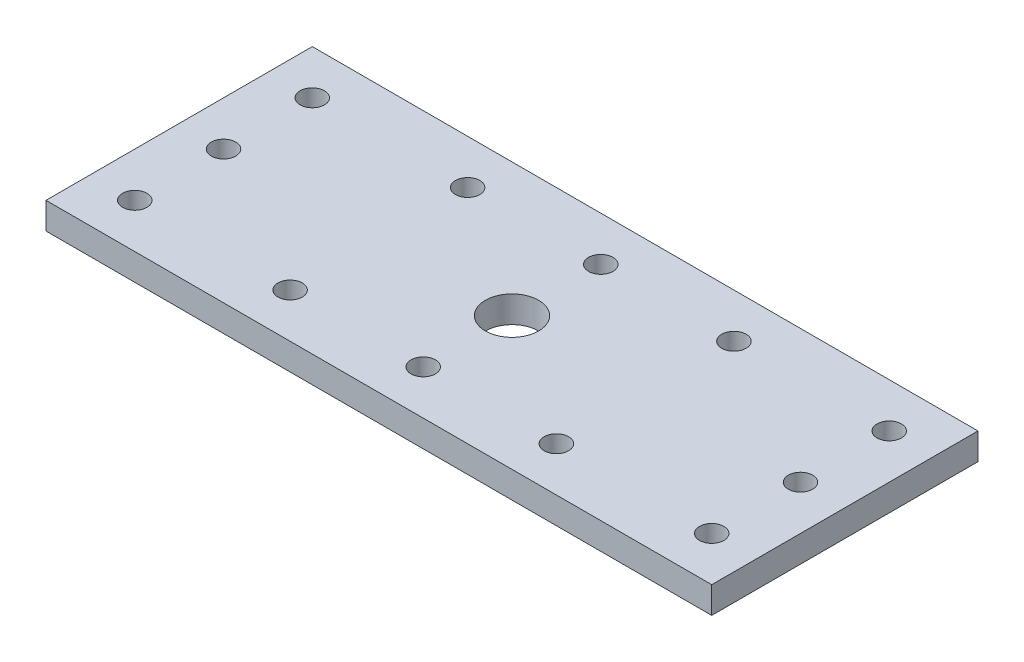
ISO-10303-21;
HEADER;
FILE_DESCRIPTION(('STEP AP214'),'2;1');
FILE_NAME('part.step','',(''),(''),'','','');
FILE_SCHEMA(('AUTOMOTIVE_DESIGN { 1 0 10303 214 1 1 1 1 }'));
ENDSEC;
DATA;
#1=APPLICATION_CONTEXT('core data for automotive mechanical design processes');
#2=APPLICATION_PROTOCOL_DEFINITION('international standard','automotive_design',2000,#1);
#3=PRODUCT_CONTEXT('',#1,'mechanical');
#4=PRODUCT('Part','Part','',(#3));
#5=PRODUCT_RELATED_PRODUCT_CATEGORY('part','',(#4));
#6=PRODUCT_DEFINITION_FORMATION('','',#4);
#7=PRODUCT_DEFINITION_CONTEXT('part definition',#1,'design');
#8=PRODUCT_DEFINITION('design','',#6,#7);
#9=PRODUCT_DEFINITION_SHAPE('','',#8);
#10=(LENGTH_UNIT() NAMED_UNIT(*) SI_UNIT(.MILLI.,.METRE.));
#11=(NAMED_UNIT(*) PLANE_ANGLE_UNIT() SI_UNIT($,.RADIAN.));
#12=(NAMED_UNIT(*) SI_UNIT($,.STERADIAN.) SOLID_ANGLE_UNIT());
#13=UNCERTAINTY_MEASURE_WITH_UNIT(LENGTH_MEASURE(1.E-05),#10,'distance_accuracy_value','');
#14=(GEOMETRIC_REPRESENTATION_CONTEXT(3) GLOBAL_UNCERTAINTY_ASSIGNED_CONTEXT((#13)) GLOBAL_UNIT_ASSIGNED_CONTEXT((#10,
#11,#12)) REPRESENTATION_CONTEXT('',''));
#15=CARTESIAN_POINT('',(0.,0.,0.));
#16=DIRECTION('',(0.,0.,1.));
#17=DIRECTION('',(1.,0.,0.));
#18=AXIS2_PLACEMENT_3D('',#15,#16,#17);
#19=CARTESIAN_POINT('',(0.,94.9999999999997,30.0000000000001));
#20=DIRECTION('',(0.,1.,0.));
#21=DIRECTION('',(-1.,0.,0.));
#22=AXIS2_PLACEMENT_3D('',#19,#20,#21);
#23=PLANE('',#22);
#24=CARTESIAN_POINT('',(-65.,94.9999999999998,30.));
#25=DIRECTION('',(0.,1.,0.));
#26=DIRECTION('',(0.,0.,1.));
#27=AXIS2_PLACEMENT_3D('',#24,#25,#26);
#28=CIRCLE('',#27,2.75);
#29=CARTESIAN_POINT('',(-65.,94.9999999999998,32.75));
#30=VERTEX_POINT('',#29);
#31=EDGE_CURVE('E118',#30,#30,#28,.T.);
#32=ORIENTED_EDGE('',*,*,#31,.T.);
#33=EDGE_LOOP('',(#32));
#34=FACE_BOUND('',#33,.T.);
#35=CARTESIAN_POINT('',(0.,94.9999999999998,9.99999999999993));
#36=DIRECTION('',(0.,1.,0.));
#37=DIRECTION('',(0.,0.,1.));
#38=AXIS2_PLACEMENT_3D('',#35,#36,#37);
#39=CIRCLE('',#38,2.75);
#40=CARTESIAN_POINT('',(0.,94.9999999999998,12.7499999999999));
#41=VERTEX_POINT('',#40);
#42=EDGE_CURVE('E122',#41,#41,#39,.T.);
#43=ORIENTED_EDGE('',*,*,#42,.T.);
#44=EDGE_LOOP('',(#43));
#45=FACE_BOUND('',#44,.T.);
#46=CARTESIAN_POINT('',(65.,94.9999999999997,30.));
#47=DIRECTION('',(0.,1.,0.));
#48=DIRECTION('',(0.,0.,1.));
#49=AXIS2_PLACEMENT_3D('',#46,#47,#48);
#50=CIRCLE('',#49,2.75);
#51=CARTESIAN_POINT('',(65.,94.9999999999997,32.75));
#52=VERTEX_POINT('',#51);
#53=EDGE_CURVE('E125',#52,#52,#50,.T.);
#54=ORIENTED_EDGE('',*,*,#53,.T.);
#55=EDGE_LOOP('',(#54));
#56=FACE_BOUND('',#55,.T.);
#57=CARTESIAN_POINT('',(30.,94.9999999999997,50.0000000000001));
#58=DIRECTION('',(0.,1.,0.));
#59=DIRECTION('',(0.,0.,1.));
#60=AXIS2_PLACEMENT_3D('',#57,#58,#59);
#61=CIRCLE('',#60,2.75);
#62=CARTESIAN_POINT('',(30.,94.9999999999997,52.7500000000001));
#63=VERTEX_POINT('',#62);
#64=EDGE_CURVE('E128',#63,#63,#61,.T.);
#65=ORIENTED_EDGE('',*,*,#64,.T.);
#66=EDGE_LOOP('',(#65));
#67=FACE_BOUND('',#66,.T.);
#68=CARTESIAN_POINT('',(-30.,94.9999999999997,9.99999999999993));
#69=DIRECTION('',(0.,1.,0.));
#70=DIRECTION('',(0.,0.,1.));
#71=AXIS2_PLACEMENT_3D('',#68,#69,#70);
#72=CIRCLE('',#71,2.75);
#73=CARTESIAN_POINT('',(-30.,94.9999999999997,12.7499999999999));
#74=VERTEX_POINT('',#73);
#75=EDGE_CURVE('E131',#74,#74,#72,.T.);
#76=ORIENTED_EDGE('',*,*,#75,.T.);
#77=EDGE_LOOP('',(#76));
#78=FACE_BOUND('',#77,.T.);
#79=CARTESIAN_POINT('',(-65.,94.9999999999997,50.0000000000001));
#80=DIRECTION('',(0.,1.,0.));
#81=DIRECTION('',(0.,0.,1.));
#82=AXIS2_PLACEMENT_3D('',#79,#80,#81);
#83=CIRCLE('',#82,2.75);
#84=CARTESIAN_POINT('',(-65.,94.9999999999997,52.7500000000001));
#85=VERTEX_POINT('',#84);
#86=EDGE_CURVE('E134',#85,#85,#83,.T.);
#87=ORIENTED_EDGE('',*,*,#86,.T.);
#88=EDGE_LOOP('',(#87));
#89=FACE_BOUND('',#88,.T.);
#90=CARTESIAN_POINT('',(-65.,94.9999999999998,9.99999999999992));
#91=DIRECTION('',(0.,1.,0.));
#92=DIRECTION('',(0.,0.,1.));
#93=AXIS2_PLACEMENT_3D('',#90,#91,#92);
#94=CIRCLE('',#93,2.75);
#95=CARTESIAN_POINT('',(-65.,94.9999999999998,12.7499999999999));
#96=VERTEX_POINT('',#95);
#97=EDGE_CURVE('E137',#96,#96,#94,.T.);
#98=ORIENTED_EDGE('',*,*,#97,.T.);
#99=EDGE_LOOP('',(#98));
#100=FACE_BOUND('',#99,.T.);
#101=CARTESIAN_POINT('',(-30.,94.9999999999997,50.0000000000001));
#102=DIRECTION('',(0.,1.,0.));
#103=DIRECTION('',(0.,0.,1.));
#104=AXIS2_PLACEMENT_3D('',#101,#102,#103);
#105=CIRCLE('',#104,2.75);
#106=CARTESIAN_POINT('',(-30.,94.9999999999997,52.7500000000001));
#107=VERTEX_POINT('',#106);
#108=EDGE_CURVE('E140',#107,#107,#105,.T.);
#109=ORIENTED_EDGE('',*,*,#108,.T.);
#110=EDGE_LOOP('',(#109));
#111=FACE_BOUND('',#110,.T.);
#112=CARTESIAN_POINT('',(30.,94.9999999999997,9.99999999999993));
#113=DIRECTION('',(0.,1.,0.));
#114=DIRECTION('',(0.,0.,1.));
#115=AXIS2_PLACEMENT_3D('',#112,#113,#114);
#116=CIRCLE('',#115,2.75);
#117=CARTESIAN_POINT('',(30.,94.9999999999997,12.7499999999999));
#118=VERTEX_POINT('',#117);
#119=EDGE_CURVE('E143',#118,#118,#116,.T.);
#120=ORIENTED_EDGE('',*,*,#119,.T.);
#121=EDGE_LOOP('',(#120));
#122=FACE_BOUND('',#121,.T.);
#123=CARTESIAN_POINT('',(65.,94.9999999999997,50.0000000000001));
#124=DIRECTION('',(0.,1.,0.));
#125=DIRECTION('',(0.,0.,1.));
#126=AXIS2_PLACEMENT_3D('',#123,#124,#125);
#127=CIRCLE('',#126,2.75);
#128=CARTESIAN_POINT('',(65.,94.9999999999997,52.7500000000001));
#129=VERTEX_POINT('',#128);
#130=EDGE_CURVE('E146',#129,#129,#127,.T.);
#131=ORIENTED_EDGE('',*,*,#130,.T.);
#132=EDGE_LOOP('',(#131));
#133=FACE_BOUND('',#132,.T.);
#134=CARTESIAN_POINT('',(65.,94.9999999999997,9.99999999999993));
#135=DIRECTION('',(0.,1.,0.));
#136=DIRECTION('',(0.,0.,1.));
#137=AXIS2_PLACEMENT_3D('',#134,#135,#136);
#138=CIRCLE('',#137,2.75);
#139=CARTESIAN_POINT('',(65.,94.9999999999997,12.7499999999999));
#140=VERTEX_POINT('',#139);
#141=EDGE_CURVE('E149',#140,#140,#138,.T.);
#142=ORIENTED_EDGE('',*,*,#141,.T.);
#143=EDGE_LOOP('',(#142));
#144=FACE_BOUND('',#143,.T.);
#145=CARTESIAN_POINT('',(0.,94.9999999999997,50.0000000000001));
#146=DIRECTION('',(0.,1.,0.));
#147=DIRECTION('',(0.,0.,1.));
#148=AXIS2_PLACEMENT_3D('',#145,#146,#147);
#149=CIRCLE('',#148,2.75);
#150=CARTESIAN_POINT('',(0.,94.9999999999997,52.7500000000001));
#151=VERTEX_POINT('',#150);
#152=EDGE_CURVE('E151',#151,#151,#149,.T.);
#153=ORIENTED_EDGE('',*,*,#152,.T.);
#154=EDGE_LOOP('',(#153));
#155=FACE_BOUND('',#154,.T.);
#156=CARTESIAN_POINT('',(0.,94.9999999999998,30.0000000000001));
#157=DIRECTION('',(0.,1.,0.));
#158=DIRECTION('',(0.,0.,1.));
#159=AXIS2_PLACEMENT_3D('',#156,#157,#158);
#160=CIRCLE('',#159,6.);
#161=CARTESIAN_POINT('',(0.,94.9999999999998,36.0000000000001));
#162=VERTEX_POINT('',#161);
#163=EDGE_CURVE('E20',#162,#162,#160,.T.);
#164=ORIENTED_EDGE('',*,*,#163,.T.);
#165=EDGE_LOOP('',(#164));
#166=FACE_BOUND('',#165,.T.);
#167=DIRECTION('',(0.,0.,1.));
#168=VECTOR('',#167,1.);
#169=CARTESIAN_POINT('',(-75.,94.9999999999998,0.));
#170=LINE('',#169,#168);
#171=CARTESIAN_POINT('',(-75.,94.9999999999998,0.));
#172=VERTEX_POINT('',#171);
#173=CARTESIAN_POINT('',(-75.,94.9999999999998,60.0000000000001));
#174=VERTEX_POINT('',#173);
#175=EDGE_CURVE('E160',#172,#174,#170,.T.);
#176=ORIENTED_EDGE('',*,*,#175,.F.);
#177=DIRECTION('',(-1.,0.,0.));
#178=VECTOR('',#177,1.);
#179=CARTESIAN_POINT('',(75.,94.9999999999997,0.));
#180=LINE('',#179,#178);
#181=CARTESIAN_POINT('',(75.,94.9999999999997,0.));
#182=VERTEX_POINT('',#181);
#183=EDGE_CURVE('E55',#182,#172,#180,.T.);
#184=ORIENTED_EDGE('',*,*,#183,.F.);
#185=DIRECTION('',(0.,0.,1.));
#186=VECTOR('',#185,1.);
#187=CARTESIAN_POINT('',(75.,94.9999999999997,60.0000000000001));
#188=LINE('',#187,#186);
#189=CARTESIAN_POINT('',(75.,94.9999999999997,60.0000000000001));
#190=VERTEX_POINT('',#189);
#191=EDGE_CURVE('E57',#190,#182,#188,.F.);
#192=ORIENTED_EDGE('',*,*,#191,.F.);
#193=DIRECTION('',(1.,0.,0.));
#194=VECTOR('',#193,1.);
#195=CARTESIAN_POINT('',(-75.,94.9999999999997,60.0000000000001));
#196=LINE('',#195,#194);
#197=EDGE_CURVE('E59',#174,#190,#196,.T.);
#198=ORIENTED_EDGE('',*,*,#197,.F.);
#199=EDGE_LOOP('',(#176,#184,#192,#198));
#200=FACE_BOUND('',#199,.T.);
#201=ADVANCED_FACE('F17',(#34,#45,#56,#67,#78,#89,#100,#111,#122,#133,#144,#155,#166,#200),#23,.F.);
#202=CARTESIAN_POINT('',(-75.,94.9999999999997,60.0000000000001));
#203=DIRECTION('',(0.,0.,1.));
#204=DIRECTION('',(1.,0.,0.));
#205=AXIS2_PLACEMENT_3D('',#202,#203,#204);
#206=PLANE('',#205);
#207=DIRECTION('',(-1.,0.,0.));
#208=VECTOR('',#207,1.);
#209=CARTESIAN_POINT('',(0.,101.,60.0000000000001));
#210=LINE('',#209,#208);
#211=CARTESIAN_POINT('',(-75.,101.,60.0000000000001));
#212=VERTEX_POINT('',#211);
#213=CARTESIAN_POINT('',(75.,101.,60.0000000000001));
#214=VERTEX_POINT('',#213);
#215=EDGE_CURVE('E121',#212,#214,#210,.F.);
#216=ORIENTED_EDGE('',*,*,#215,.F.);
#217=DIRECTION('',(0.,-1.,0.));
#218=VECTOR('',#217,1.);
#219=CARTESIAN_POINT('',(-75.,94.9999999999998,60.0000000000001));
#220=LINE('',#219,#218);
#221=EDGE_CURVE('E70',#174,#212,#220,.F.);
#222=ORIENTED_EDGE('',*,*,#221,.F.);
#223=ORIENTED_EDGE('',*,*,#197,.T.);
#224=DIRECTION('',(0.,1.,0.));
#225=VECTOR('',#224,1.);
#226=CARTESIAN_POINT('',(75.,94.9999999999997,60.0000000000001));
#227=LINE('',#226,#225);
#228=EDGE_CURVE('E64',#214,#190,#227,.F.);
#229=ORIENTED_EDGE('',*,*,#228,.F.);
#230=EDGE_LOOP('',(#216,#222,#223,#229));
#231=FACE_BOUND('',#230,.T.);
#232=ADVANCED_FACE('F67',(#231),#206,.T.);
#233=CARTESIAN_POINT('',(75.,94.9999999999997,60.0000000000001));
#234=DIRECTION('',(1.,0.,0.));
#235=DIRECTION('',(0.,1.,0.));
#236=AXIS2_PLACEMENT_3D('',#233,#234,#235);
#237=PLANE('',#236);
#238=DIRECTION('',(0.,0.,1.));
#239=VECTOR('',#238,1.);
#240=CARTESIAN_POINT('',(75.,101.,30.0000000000001));
#241=LINE('',#240,#239);
#242=CARTESIAN_POINT('',(75.,101.,0.));
#243=VERTEX_POINT('',#242);
#244=EDGE_CURVE('E75',#214,#243,#241,.F.);
#245=ORIENTED_EDGE('',*,*,#244,.F.);
#246=ORIENTED_EDGE('',*,*,#228,.T.);
#247=ORIENTED_EDGE('',*,*,#191,.T.);
#248=DIRECTION('',(0.,1.,0.));
#249=VECTOR('',#248,1.);
#250=CARTESIAN_POINT('',(75.,94.9999999999997,0.));
#251=LINE('',#250,#249);
#252=EDGE_CURVE('E78',#243,#182,#251,.F.);
#253=ORIENTED_EDGE('',*,*,#252,.F.);
#254=EDGE_LOOP('',(#245,#246,#247,#253));
#255=FACE_BOUND('',#254,.T.);
#256=ADVANCED_FACE('F73',(#255),#237,.T.);
#257=CARTESIAN_POINT('',(75.,94.9999999999997,0.));
#258=DIRECTION('',(0.,0.,-1.));
#259=DIRECTION('',(-1.,0.,0.));
#260=AXIS2_PLACEMENT_3D('',#257,#258,#259);
#261=PLANE('',#260);
#262=DIRECTION('',(-1.,0.,0.));
#263=VECTOR('',#262,1.);
#264=CARTESIAN_POINT('',(0.,101.,0.));
#265=LINE('',#264,#263);
#266=CARTESIAN_POINT('',(-75.,101.,0.));
#267=VERTEX_POINT('',#266);
#268=EDGE_CURVE('E167',#243,#267,#265,.T.);
#269=ORIENTED_EDGE('',*,*,#268,.F.);
#270=ORIENTED_EDGE('',*,*,#252,.T.);
#271=ORIENTED_EDGE('',*,*,#183,.T.);
#272=DIRECTION('',(0.,-1.,0.));
#273=VECTOR('',#272,1.);
#274=CARTESIAN_POINT('',(-75.,94.9999999999998,0.));
#275=LINE('',#274,#273);
#276=EDGE_CURVE('E35',#267,#172,#275,.T.);
#277=ORIENTED_EDGE('',*,*,#276,.F.);
#278=EDGE_LOOP('',(#269,#270,#271,#277));
#279=FACE_BOUND('',#278,.T.);
#280=ADVANCED_FACE('F165',(#279),#261,.T.);
#281=CARTESIAN_POINT('',(-75.,94.9999999999998,0.));
#282=DIRECTION('',(-1.,0.,0.));
#283=DIRECTION('',(0.,-1.,0.));
#284=AXIS2_PLACEMENT_3D('',#281,#282,#283);
#285=PLANE('',#284);
#286=DIRECTION('',(0.,0.,1.));
#287=VECTOR('',#286,1.);
#288=CARTESIAN_POINT('',(-75.,101.,30.0000000000001));
#289=LINE('',#288,#287);
#290=EDGE_CURVE('E117',#267,#212,#289,.T.);
#291=ORIENTED_EDGE('',*,*,#290,.F.);
#292=ORIENTED_EDGE('',*,*,#276,.T.);
#293=ORIENTED_EDGE('',*,*,#175,.T.);
#294=ORIENTED_EDGE('',*,*,#221,.T.);
#295=EDGE_LOOP('',(#291,#292,#293,#294));
#296=FACE_BOUND('',#295,.T.);
#297=ADVANCED_FACE('F173',(#296),#285,.T.);
#298=CARTESIAN_POINT('',(0.,98.2999999999998,30.0000000000001));
#299=DIRECTION('',(0.,1.,0.));
#300=DIRECTION('',(0.,0.,1.));
#301=AXIS2_PLACEMENT_3D('',#298,#299,#300);
#302=CYLINDRICAL_SURFACE('',#301,6.);
#303=CARTESIAN_POINT('',(0.,101.,30.0000000000001));
#304=DIRECTION('',(0.,1.,0.));
#305=DIRECTION('',(0.,0.,1.));
#306=AXIS2_PLACEMENT_3D('',#303,#304,#305);
#307=CIRCLE('',#306,6.);
#308=CARTESIAN_POINT('',(0.,101.,36.0000000000001));
#309=VERTEX_POINT('',#308);
#310=EDGE_CURVE('E114',#309,#309,#307,.F.);
#311=ORIENTED_EDGE('',*,*,#310,.F.);
#312=EDGE_LOOP('',(#311));
#313=FACE_BOUND('',#312,.T.);
#314=ORIENTED_EDGE('',*,*,#163,.F.);
#315=EDGE_LOOP('',(#314));
#316=FACE_BOUND('',#315,.T.);
#317=ADVANCED_FACE('F175',(#313,#316),#302,.F.);
#318=CARTESIAN_POINT('',(0.,98.2999999999998,50.0000000000001));
#319=DIRECTION('',(0.,1.,0.));
#320=DIRECTION('',(0.,0.,1.));
#321=AXIS2_PLACEMENT_3D('',#318,#319,#320);
#322=CYLINDRICAL_SURFACE('',#321,2.75);
#323=CARTESIAN_POINT('',(0.,101.,50.0000000000001));
#324=DIRECTION('',(0.,1.,0.));
#325=DIRECTION('',(0.,0.,1.));
#326=AXIS2_PLACEMENT_3D('',#323,#324,#325);
#327=CIRCLE('',#326,2.75);
#328=CARTESIAN_POINT('',(0.,101.,52.7500000000001));
#329=VERTEX_POINT('',#328);
#330=EDGE_CURVE('E111',#329,#329,#327,.F.);
#331=ORIENTED_EDGE('',*,*,#330,.F.);
#332=EDGE_LOOP('',(#331));
#333=FACE_BOUND('',#332,.T.);
#334=ORIENTED_EDGE('',*,*,#152,.F.);
#335=EDGE_LOOP('',(#334));
#336=FACE_BOUND('',#335,.T.);
#337=ADVANCED_FACE('F182',(#333,#336),#322,.F.);
#338=CARTESIAN_POINT('',(65.,98.2999999999998,9.99999999999993));
#339=DIRECTION('',(0.,1.,0.));
#340=DIRECTION('',(0.,0.,1.));
#341=AXIS2_PLACEMENT_3D('',#338,#339,#340);
#342=CYLINDRICAL_SURFACE('',#341,2.75);
#343=CARTESIAN_POINT('',(65.,101.,9.99999999999993));
#344=DIRECTION('',(0.,1.,0.));
#345=DIRECTION('',(0.,0.,1.));
#346=AXIS2_PLACEMENT_3D('',#343,#344,#345);
#347=CIRCLE('',#346,2.75);
#348=CARTESIAN_POINT('',(65.,101.,12.7499999999999));
#349=VERTEX_POINT('',#348);
#350=EDGE_CURVE('E108',#349,#349,#347,.F.);
#351=ORIENTED_EDGE('',*,*,#350,.F.);
#352=EDGE_LOOP('',(#351));
#353=FACE_BOUND('',#352,.T.);
#354=ORIENTED_EDGE('',*,*,#141,.F.);
#355=EDGE_LOOP('',(#354));
#356=FACE_BOUND('',#355,.T.);
#357=ADVANCED_FACE('F232',(#353,#356),#342,.F.);
#358=CARTESIAN_POINT('',(65.,98.2999999999998,50.0000000000001));
#359=DIRECTION('',(0.,1.,0.));
#360=DIRECTION('',(0.,0.,1.));
#361=AXIS2_PLACEMENT_3D('',#358,#359,#360);
#362=CYLINDRICAL_SURFACE('',#361,2.75);
#363=CARTESIAN_POINT('',(65.,101.,50.0000000000001));
#364=DIRECTION('',(0.,1.,0.));
#365=DIRECTION('',(0.,0.,1.));
#366=AXIS2_PLACEMENT_3D('',#363,#364,#365);
#367=CIRCLE('',#366,2.75);
#368=CARTESIAN_POINT('',(65.,101.,52.7500000000001));
#369=VERTEX_POINT('',#368);
#370=EDGE_CURVE('E105',#369,#369,#367,.F.);
#371=ORIENTED_EDGE('',*,*,#370,.F.);
#372=EDGE_LOOP('',(#371));
#373=FACE_BOUND('',#372,.T.);
#374=ORIENTED_EDGE('',*,*,#130,.F.);
#375=EDGE_LOOP('',(#374));
#376=FACE_BOUND('',#375,.T.);
#377=ADVANCED_FACE('F228',(#373,#376),#362,.F.);
#378=CARTESIAN_POINT('',(30.,98.2999999999998,9.99999999999993));
#379=DIRECTION('',(0.,1.,0.));
#380=DIRECTION('',(0.,0.,1.));
#381=AXIS2_PLACEMENT_3D('',#378,#379,#380);
#382=CYLINDRICAL_SURFACE('',#381,2.75);
#383=CARTESIAN_POINT('',(30.,101.,9.99999999999993));
#384=DIRECTION('',(0.,1.,0.));
#385=DIRECTION('',(0.,0.,1.));
#386=AXIS2_PLACEMENT_3D('',#383,#384,#385);
#387=CIRCLE('',#386,2.75);
#388=CARTESIAN_POINT('',(30.,101.,12.7499999999999));
#389=VERTEX_POINT('',#388);
#390=EDGE_CURVE('E102',#389,#389,#387,.F.);
#391=ORIENTED_EDGE('',*,*,#390,.F.);
#392=EDGE_LOOP('',(#391));
#393=FACE_BOUND('',#392,.T.);
#394=ORIENTED_EDGE('',*,*,#119,.F.);
#395=EDGE_LOOP('',(#394));
#396=FACE_BOUND('',#395,.T.);
#397=ADVANCED_FACE('F224',(#393,#396),#382,.F.);
#398=CARTESIAN_POINT('',(-30.,98.2999999999998,50.0000000000001));
#399=DIRECTION('',(0.,1.,0.));
#400=DIRECTION('',(0.,0.,1.));
#401=AXIS2_PLACEMENT_3D('',#398,#399,#400);
#402=CYLINDRICAL_SURFACE('',#401,2.75);
#403=CARTESIAN_POINT('',(-30.,101.,50.0000000000001));
#404=DIRECTION('',(0.,1.,0.));
#405=DIRECTION('',(0.,0.,1.));
#406=AXIS2_PLACEMENT_3D('',#403,#404,#405);
#407=CIRCLE('',#406,2.75);
#408=CARTESIAN_POINT('',(-30.,101.,52.7500000000001));
#409=VERTEX_POINT('',#408);
#410=EDGE_CURVE('E99',#409,#409,#407,.F.);
#411=ORIENTED_EDGE('',*,*,#410,.F.);
#412=EDGE_LOOP('',(#411));
#413=FACE_BOUND('',#412,.T.);
#414=ORIENTED_EDGE('',*,*,#108,.F.);
#415=EDGE_LOOP('',(#414));
#416=FACE_BOUND('',#415,.T.);
#417=ADVANCED_FACE('F220',(#413,#416),#402,.F.);
#418=CARTESIAN_POINT('',(-65.,98.2999999999998,9.99999999999992));
#419=DIRECTION('',(0.,1.,0.));
#420=DIRECTION('',(0.,0.,1.));
#421=AXIS2_PLACEMENT_3D('',#418,#419,#420);
#422=CYLINDRICAL_SURFACE('',#421,2.75);
#423=CARTESIAN_POINT('',(-65.,101.,9.99999999999992));
#424=DIRECTION('',(0.,1.,0.));
#425=DIRECTION('',(0.,0.,1.));
#426=AXIS2_PLACEMENT_3D('',#423,#424,#425);
#427=CIRCLE('',#426,2.75);
#428=CARTESIAN_POINT('',(-65.,101.,12.7499999999999));
#429=VERTEX_POINT('',#428);
#430=EDGE_CURVE('E96',#429,#429,#427,.F.);
#431=ORIENTED_EDGE('',*,*,#430,.F.);
#432=EDGE_LOOP('',(#431));
#433=FACE_BOUND('',#432,.T.);
#434=ORIENTED_EDGE('',*,*,#97,.F.);
#435=EDGE_LOOP('',(#434));
#436=FACE_BOUND('',#435,.T.);
#437=ADVANCED_FACE('F216',(#433,#436),#422,.F.);
#438=CARTESIAN_POINT('',(-65.,98.2999999999998,50.0000000000001));
#439=DIRECTION('',(0.,1.,0.));
#440=DIRECTION('',(0.,0.,1.));
#441=AXIS2_PLACEMENT_3D('',#438,#439,#440);
#442=CYLINDRICAL_SURFACE('',#441,2.75);
#443=CARTESIAN_POINT('',(-65.,101.,50.0000000000001));
#444=DIRECTION('',(0.,1.,0.));
#445=DIRECTION('',(0.,0.,1.));
#446=AXIS2_PLACEMENT_3D('',#443,#444,#445);
#447=CIRCLE('',#446,2.75);
#448=CARTESIAN_POINT('',(-65.,101.,52.7500000000001));
#449=VERTEX_POINT('',#448);
#450=EDGE_CURVE('E93',#449,#449,#447,.F.);
#451=ORIENTED_EDGE('',*,*,#450,.F.);
#452=EDGE_LOOP('',(#451));
#453=FACE_BOUND('',#452,.T.);
#454=ORIENTED_EDGE('',*,*,#86,.F.);
#455=EDGE_LOOP('',(#454));
#456=FACE_BOUND('',#455,.T.);
#457=ADVANCED_FACE('F212',(#453,#456),#442,.F.);
#458=CARTESIAN_POINT('',(-30.,98.2999999999998,9.99999999999993));
#459=DIRECTION('',(0.,1.,0.));
#460=DIRECTION('',(0.,0.,1.));
#461=AXIS2_PLACEMENT_3D('',#458,#459,#460);
#462=CYLINDRICAL_SURFACE('',#461,2.75);
#463=CARTESIAN_POINT('',(-30.,101.,9.99999999999993));
#464=DIRECTION('',(0.,1.,0.));
#465=DIRECTION('',(0.,0.,1.));
#466=AXIS2_PLACEMENT_3D('',#463,#464,#465);
#467=CIRCLE('',#466,2.75);
#468=CARTESIAN_POINT('',(-30.,101.,12.7499999999999));
#469=VERTEX_POINT('',#468);
#470=EDGE_CURVE('E90',#469,#469,#467,.F.);
#471=ORIENTED_EDGE('',*,*,#470,.F.);
#472=EDGE_LOOP('',(#471));
#473=FACE_BOUND('',#472,.T.);
#474=ORIENTED_EDGE('',*,*,#75,.F.);
#475=EDGE_LOOP('',(#474));
#476=FACE_BOUND('',#475,.T.);
#477=ADVANCED_FACE('F208',(#473,#476),#462,.F.);
#478=CARTESIAN_POINT('',(30.,98.2999999999998,50.0000000000001));
#479=DIRECTION('',(0.,1.,0.));
#480=DIRECTION('',(0.,0.,1.));
#481=AXIS2_PLACEMENT_3D('',#478,#479,#480);
#482=CYLINDRICAL_SURFACE('',#481,2.75);
#483=CARTESIAN_POINT('',(30.,101.,50.0000000000001));
#484=DIRECTION('',(0.,1.,0.));
#485=DIRECTION('',(0.,0.,1.));
#486=AXIS2_PLACEMENT_3D('',#483,#484,#485);
#487=CIRCLE('',#486,2.75);
#488=CARTESIAN_POINT('',(30.,101.,52.7500000000001));
#489=VERTEX_POINT('',#488);
#490=EDGE_CURVE('E87',#489,#489,#487,.F.);
#491=ORIENTED_EDGE('',*,*,#490,.F.);
#492=EDGE_LOOP('',(#491));
#493=FACE_BOUND('',#492,.T.);
#494=ORIENTED_EDGE('',*,*,#64,.F.);
#495=EDGE_LOOP('',(#494));
#496=FACE_BOUND('',#495,.T.);
#497=ADVANCED_FACE('F204',(#493,#496),#482,.F.);
#498=CARTESIAN_POINT('',(65.,98.2999999999998,30.));
#499=DIRECTION('',(0.,1.,0.));
#500=DIRECTION('',(0.,0.,1.));
#501=AXIS2_PLACEMENT_3D('',#498,#499,#500);
#502=CYLINDRICAL_SURFACE('',#501,2.75);
#503=CARTESIAN_POINT('',(65.,101.,30.));
#504=DIRECTION('',(0.,1.,0.));
#505=DIRECTION('',(0.,0.,1.));
#506=AXIS2_PLACEMENT_3D('',#503,#504,#505);
#507=CIRCLE('',#506,2.75);
#508=CARTESIAN_POINT('',(65.,101.,32.75));
#509=VERTEX_POINT('',#508);
#510=EDGE_CURVE('E84',#509,#509,#507,.F.);
#511=ORIENTED_EDGE('',*,*,#510,.F.);
#512=EDGE_LOOP('',(#511));
#513=FACE_BOUND('',#512,.T.);
#514=ORIENTED_EDGE('',*,*,#53,.F.);
#515=EDGE_LOOP('',(#514));
#516=FACE_BOUND('',#515,.T.);
#517=ADVANCED_FACE('F200',(#513,#516),#502,.F.);
#518=CARTESIAN_POINT('',(0.,98.2999999999998,9.99999999999993));
#519=DIRECTION('',(0.,1.,0.));
#520=DIRECTION('',(0.,0.,1.));
#521=AXIS2_PLACEMENT_3D('',#518,#519,#520);
#522=CYLINDRICAL_SURFACE('',#521,2.75);
#523=CARTESIAN_POINT('',(0.,101.,9.99999999999993));
#524=DIRECTION('',(0.,1.,0.));
#525=DIRECTION('',(0.,0.,1.));
#526=AXIS2_PLACEMENT_3D('',#523,#524,#525);
#527=CIRCLE('',#526,2.75);
#528=CARTESIAN_POINT('',(0.,101.,12.7499999999999));
#529=VERTEX_POINT('',#528);
#530=EDGE_CURVE('E26',#529,#529,#527,.F.);
#531=ORIENTED_EDGE('',*,*,#530,.F.);
#532=EDGE_LOOP('',(#531));
#533=FACE_BOUND('',#532,.T.);
#534=ORIENTED_EDGE('',*,*,#42,.F.);
#535=EDGE_LOOP('',(#534));
#536=FACE_BOUND('',#535,.T.);
#537=ADVANCED_FACE('F193',(#533,#536),#522,.F.);
#538=CARTESIAN_POINT('',(-65.,98.2999999999998,30.));
#539=DIRECTION('',(0.,1.,0.));
#540=DIRECTION('',(0.,0.,1.));
#541=AXIS2_PLACEMENT_3D('',#538,#539,#540);
#542=CYLINDRICAL_SURFACE('',#541,2.75);
#543=CARTESIAN_POINT('',(-65.,101.,30.));
#544=DIRECTION('',(0.,1.,0.));
#545=DIRECTION('',(0.,0.,1.));
#546=AXIS2_PLACEMENT_3D('',#543,#544,#545);
#547=CIRCLE('',#546,2.75);
#548=CARTESIAN_POINT('',(-65.,101.,32.75));
#549=VERTEX_POINT('',#548);
#550=EDGE_CURVE('E11',#549,#549,#547,.F.);
#551=ORIENTED_EDGE('',*,*,#550,.F.);
#552=EDGE_LOOP('',(#551));
#553=FACE_BOUND('',#552,.T.);
#554=ORIENTED_EDGE('',*,*,#31,.F.);
#555=EDGE_LOOP('',(#554));
#556=FACE_BOUND('',#555,.T.);
#557=ADVANCED_FACE('F187',(#553,#556),#542,.F.);
#558=CARTESIAN_POINT('',(0.,101.,30.0000000000001));
#559=DIRECTION('',(0.,1.,0.));
#560=DIRECTION('',(-1.,0.,0.));
#561=AXIS2_PLACEMENT_3D('',#558,#559,#560);
#562=PLANE('',#561);
#563=ORIENTED_EDGE('',*,*,#550,.T.);
#564=EDGE_LOOP('',(#563));
#565=FACE_BOUND('',#564,.T.);
#566=ORIENTED_EDGE('',*,*,#530,.T.);
#567=EDGE_LOOP('',(#566));
#568=FACE_BOUND('',#567,.T.);
#569=ORIENTED_EDGE('',*,*,#510,.T.);
#570=EDGE_LOOP('',(#569));
#571=FACE_BOUND('',#570,.T.);
#572=ORIENTED_EDGE('',*,*,#490,.T.);
#573=EDGE_LOOP('',(#572));
#574=FACE_BOUND('',#573,.T.);
#575=ORIENTED_EDGE('',*,*,#470,.T.);
#576=EDGE_LOOP('',(#575));
#577=FACE_BOUND('',#576,.T.);
#578=ORIENTED_EDGE('',*,*,#450,.T.);
#579=EDGE_LOOP('',(#578));
#580=FACE_BOUND('',#579,.T.);
#581=ORIENTED_EDGE('',*,*,#430,.T.);
#582=EDGE_LOOP('',(#581));
#583=FACE_BOUND('',#582,.T.);
#584=ORIENTED_EDGE('',*,*,#410,.T.);
#585=EDGE_LOOP('',(#584));
#586=FACE_BOUND('',#585,.T.);
#587=ORIENTED_EDGE('',*,*,#390,.T.);
#588=EDGE_LOOP('',(#587));
#589=FACE_BOUND('',#588,.T.);
#590=ORIENTED_EDGE('',*,*,#370,.T.);
#591=EDGE_LOOP('',(#590));
#592=FACE_BOUND('',#591,.T.);
#593=ORIENTED_EDGE('',*,*,#350,.T.);
#594=EDGE_LOOP('',(#593));
#595=FACE_BOUND('',#594,.T.);
#596=ORIENTED_EDGE('',*,*,#330,.T.);
#597=EDGE_LOOP('',(#596));
#598=FACE_BOUND('',#597,.T.);
#599=ORIENTED_EDGE('',*,*,#310,.T.);
#600=EDGE_LOOP('',(#599));
#601=FACE_BOUND('',#600,.T.);
#602=ORIENTED_EDGE('',*,*,#268,.T.);
#603=ORIENTED_EDGE('',*,*,#290,.T.);
#604=ORIENTED_EDGE('',*,*,#215,.T.);
#605=ORIENTED_EDGE('',*,*,#244,.T.);
#606=EDGE_LOOP('',(#602,#603,#604,#605));
#607=FACE_BOUND('',#606,.T.);
#608=ADVANCED_FACE('F171',(#565,#568,#571,#574,#577,#580,#583,#586,#589,#592,#595,#598,#601,
#607),#562,.T.);
#609=CLOSED_SHELL('',(#201,#232,#256,#280,#297,#317,#337,#357,#377,#397,#417,#437,#457,#477,
#497,#517,#537,#557,#608));
#610=MANIFOLD_SOLID_BREP('B1',#609);
#611=ADVANCED_BREP_SHAPE_REPRESENTATION('',(#18,#610),#14);
#612=SHAPE_DEFINITION_REPRESENTATION(#9,#611);
ENDSEC;
END-ISO-10303-21;
